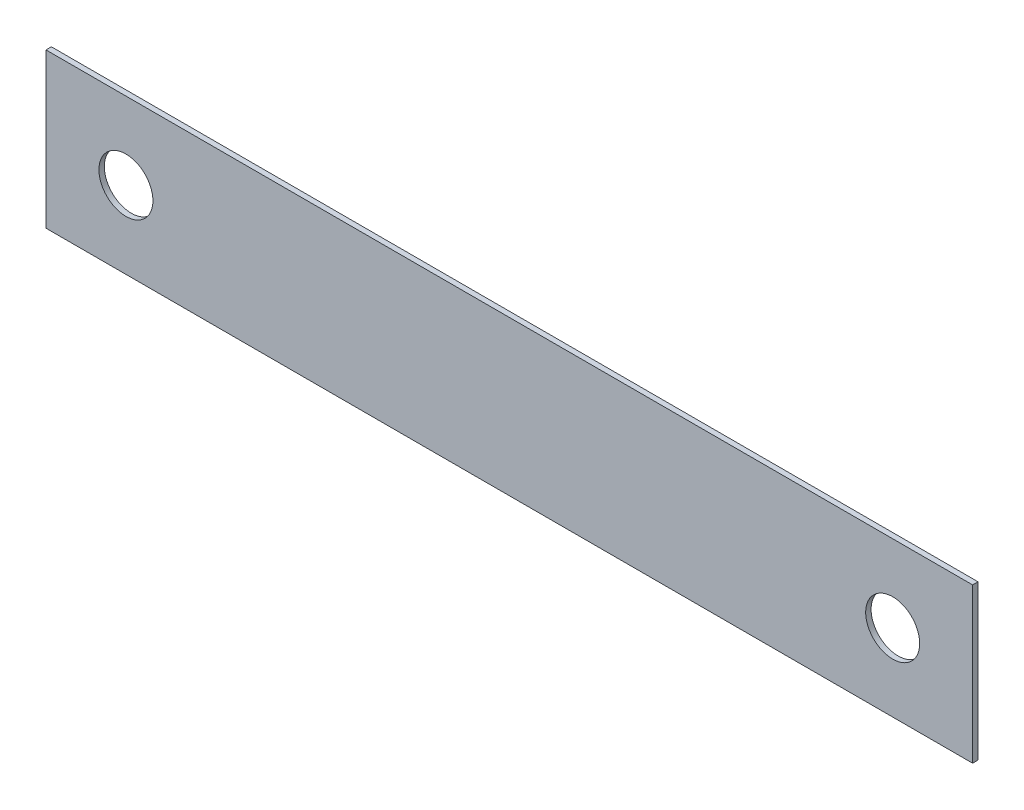
ISO-10303-21;
HEADER;
FILE_DESCRIPTION(('STEP AP214'),'2;1');
FILE_NAME('part.step','',(''),(''),'','','');
FILE_SCHEMA(('AUTOMOTIVE_DESIGN { 1 0 10303 214 1 1 1 1 }'));
ENDSEC;
DATA;
#1=APPLICATION_CONTEXT('core data for automotive mechanical design processes');
#2=APPLICATION_PROTOCOL_DEFINITION('international standard','automotive_design',2000,#1);
#3=PRODUCT_CONTEXT('',#1,'mechanical');
#4=PRODUCT('Part','Part','',(#3));
#5=PRODUCT_RELATED_PRODUCT_CATEGORY('part','',(#4));
#6=PRODUCT_DEFINITION_FORMATION('','',#4);
#7=PRODUCT_DEFINITION_CONTEXT('part definition',#1,'design');
#8=PRODUCT_DEFINITION('design','',#6,#7);
#9=PRODUCT_DEFINITION_SHAPE('','',#8);
#10=(LENGTH_UNIT() NAMED_UNIT(*) SI_UNIT(.MILLI.,.METRE.));
#11=(NAMED_UNIT(*) PLANE_ANGLE_UNIT() SI_UNIT($,.RADIAN.));
#12=(NAMED_UNIT(*) SI_UNIT($,.STERADIAN.) SOLID_ANGLE_UNIT());
#13=UNCERTAINTY_MEASURE_WITH_UNIT(LENGTH_MEASURE(1.E-05),#10,'distance_accuracy_value','');
#14=(GEOMETRIC_REPRESENTATION_CONTEXT(3) GLOBAL_UNCERTAINTY_ASSIGNED_CONTEXT((#13)) GLOBAL_UNIT_ASSIGNED_CONTEXT((#10,
#11,#12)) REPRESENTATION_CONTEXT('',''));
#15=CARTESIAN_POINT('',(0.,0.,0.));
#16=DIRECTION('',(0.,0.,1.));
#17=DIRECTION('',(1.,0.,0.));
#18=AXIS2_PLACEMENT_3D('',#15,#16,#17);
#19=CARTESIAN_POINT('',(0.,0.,0.5));
#20=DIRECTION('',(0.,0.,-1.));
#21=DIRECTION('',(-1.,0.,0.));
#22=AXIS2_PLACEMENT_3D('',#19,#20,#21);
#23=PLANE('',#22);
#24=CARTESIAN_POINT('',(7.40000000000001,7.15000000000001,0.5));
#25=DIRECTION('',(0.,0.,1.));
#26=DIRECTION('',(1.,0.,0.));
#27=AXIS2_PLACEMENT_3D('',#24,#25,#26);
#28=CIRCLE('',#27,2.5);
#29=CARTESIAN_POINT('',(9.90000000000001,7.15000000000001,0.5));
#30=VERTEX_POINT('',#29);
#31=EDGE_CURVE('E101',#30,#30,#28,.T.);
#32=ORIENTED_EDGE('',*,*,#31,.F.);
#33=EDGE_LOOP('',(#32));
#34=FACE_BOUND('',#33,.T.);
#35=DIRECTION('',(0.,-1.,0.));
#36=VECTOR('',#35,1.);
#37=CARTESIAN_POINT('',(0.,0.,0.5));
#38=LINE('',#37,#36);
#39=CARTESIAN_POINT('',(0.,14.3,0.5));
#40=VERTEX_POINT('',#39);
#41=CARTESIAN_POINT('',(0.,0.,0.5));
#42=VERTEX_POINT('',#41);
#43=EDGE_CURVE('E86',#40,#42,#38,.T.);
#44=ORIENTED_EDGE('',*,*,#43,.T.);
#45=DIRECTION('',(1.,0.,0.));
#46=VECTOR('',#45,1.);
#47=CARTESIAN_POINT('',(0.,0.,0.5));
#48=LINE('',#47,#46);
#49=CARTESIAN_POINT('',(85.8,0.,0.5));
#50=VERTEX_POINT('',#49);
#51=EDGE_CURVE('E81',#42,#50,#48,.T.);
#52=ORIENTED_EDGE('',*,*,#51,.T.);
#53=DIRECTION('',(0.,1.,0.));
#54=VECTOR('',#53,1.);
#55=CARTESIAN_POINT('',(85.8,0.,0.5));
#56=LINE('',#55,#54);
#57=CARTESIAN_POINT('',(85.8,14.3,0.5));
#58=VERTEX_POINT('',#57);
#59=EDGE_CURVE('E84',#50,#58,#56,.T.);
#60=ORIENTED_EDGE('',*,*,#59,.T.);
#61=DIRECTION('',(-1.,0.,0.));
#62=VECTOR('',#61,1.);
#63=CARTESIAN_POINT('',(0.,14.3,0.5));
#64=LINE('',#63,#62);
#65=EDGE_CURVE('E51',#58,#40,#64,.T.);
#66=ORIENTED_EDGE('',*,*,#65,.T.);
#67=EDGE_LOOP('',(#44,#52,#60,#66));
#68=FACE_BOUND('',#67,.T.);
#69=CARTESIAN_POINT('',(78.4,7.15000000000002,0.5));
#70=DIRECTION('',(0.,0.,1.));
#71=DIRECTION('',(1.,0.,0.));
#72=AXIS2_PLACEMENT_3D('',#69,#70,#71);
#73=CIRCLE('',#72,2.5);
#74=CARTESIAN_POINT('',(80.9,7.15000000000002,0.5));
#75=VERTEX_POINT('',#74);
#76=EDGE_CURVE('E116',#75,#75,#73,.T.);
#77=ORIENTED_EDGE('',*,*,#76,.F.);
#78=EDGE_LOOP('',(#77));
#79=FACE_BOUND('',#78,.T.);
#80=ADVANCED_FACE('F34',(#34,#68,#79),#23,.F.);
#81=CARTESIAN_POINT('',(0.,0.,0.));
#82=DIRECTION('',(0.,0.,-1.));
#83=DIRECTION('',(-1.,0.,0.));
#84=AXIS2_PLACEMENT_3D('',#81,#82,#83);
#85=PLANE('',#84);
#86=CARTESIAN_POINT('',(7.40000000000001,7.15000000000001,0.));
#87=DIRECTION('',(0.,0.,1.));
#88=DIRECTION('',(1.,0.,0.));
#89=AXIS2_PLACEMENT_3D('',#86,#87,#88);
#90=CIRCLE('',#89,2.5);
#91=CARTESIAN_POINT('',(9.90000000000001,7.15000000000001,0.));
#92=VERTEX_POINT('',#91);
#93=EDGE_CURVE('E113',#92,#92,#90,.T.);
#94=ORIENTED_EDGE('',*,*,#93,.T.);
#95=EDGE_LOOP('',(#94));
#96=FACE_BOUND('',#95,.T.);
#97=DIRECTION('',(0.,-1.,0.));
#98=VECTOR('',#97,1.);
#99=CARTESIAN_POINT('',(0.,0.,0.));
#100=LINE('',#99,#98);
#101=CARTESIAN_POINT('',(0.,14.3,0.));
#102=VERTEX_POINT('',#101);
#103=CARTESIAN_POINT('',(0.,0.,0.));
#104=VERTEX_POINT('',#103);
#105=EDGE_CURVE('E98',#102,#104,#100,.T.);
#106=ORIENTED_EDGE('',*,*,#105,.F.);
#107=DIRECTION('',(-1.,0.,0.));
#108=VECTOR('',#107,1.);
#109=CARTESIAN_POINT('',(0.,14.3,0.));
#110=LINE('',#109,#108);
#111=CARTESIAN_POINT('',(85.8,14.3,0.));
#112=VERTEX_POINT('',#111);
#113=EDGE_CURVE('E74',#112,#102,#110,.T.);
#114=ORIENTED_EDGE('',*,*,#113,.F.);
#115=DIRECTION('',(0.,1.,0.));
#116=VECTOR('',#115,1.);
#117=CARTESIAN_POINT('',(85.8,0.,0.));
#118=LINE('',#117,#116);
#119=CARTESIAN_POINT('',(85.8,0.,0.));
#120=VERTEX_POINT('',#119);
#121=EDGE_CURVE('E68',#120,#112,#118,.T.);
#122=ORIENTED_EDGE('',*,*,#121,.F.);
#123=DIRECTION('',(1.,0.,0.));
#124=VECTOR('',#123,1.);
#125=CARTESIAN_POINT('',(0.,0.,0.));
#126=LINE('',#125,#124);
#127=EDGE_CURVE('E90',#104,#120,#126,.T.);
#128=ORIENTED_EDGE('',*,*,#127,.F.);
#129=EDGE_LOOP('',(#106,#114,#122,#128));
#130=FACE_BOUND('',#129,.T.);
#131=CARTESIAN_POINT('',(78.4,7.15000000000002,0.));
#132=DIRECTION('',(0.,0.,1.));
#133=DIRECTION('',(1.,0.,0.));
#134=AXIS2_PLACEMENT_3D('',#131,#132,#133);
#135=CIRCLE('',#134,2.5);
#136=CARTESIAN_POINT('',(80.9,7.15000000000002,0.));
#137=VERTEX_POINT('',#136);
#138=EDGE_CURVE('E119',#137,#137,#135,.T.);
#139=ORIENTED_EDGE('',*,*,#138,.T.);
#140=EDGE_LOOP('',(#139));
#141=FACE_BOUND('',#140,.T.);
#142=ADVANCED_FACE('F109',(#96,#130,#141),#85,.T.);
#143=CARTESIAN_POINT('',(0.,0.,0.5));
#144=DIRECTION('',(1.,0.,0.));
#145=DIRECTION('',(0.,0.,-1.));
#146=AXIS2_PLACEMENT_3D('',#143,#144,#145);
#147=PLANE('',#146);
#148=ORIENTED_EDGE('',*,*,#105,.T.);
#149=DIRECTION('',(0.,0.,-1.));
#150=VECTOR('',#149,1.);
#151=CARTESIAN_POINT('',(0.,0.,0.5));
#152=LINE('',#151,#150);
#153=EDGE_CURVE('E11',#42,#104,#152,.T.);
#154=ORIENTED_EDGE('',*,*,#153,.F.);
#155=ORIENTED_EDGE('',*,*,#43,.F.);
#156=DIRECTION('',(0.,0.,-1.));
#157=VECTOR('',#156,1.);
#158=CARTESIAN_POINT('',(0.,14.3,0.5));
#159=LINE('',#158,#157);
#160=EDGE_CURVE('E94',#40,#102,#159,.T.);
#161=ORIENTED_EDGE('',*,*,#160,.T.);
#162=EDGE_LOOP('',(#148,#154,#155,#161));
#163=FACE_BOUND('',#162,.T.);
#164=ADVANCED_FACE('F36',(#163),#147,.F.);
#165=CARTESIAN_POINT('',(0.,0.,0.5));
#166=DIRECTION('',(0.,1.,0.));
#167=DIRECTION('',(0.,0.,1.));
#168=AXIS2_PLACEMENT_3D('',#165,#166,#167);
#169=PLANE('',#168);
#170=ORIENTED_EDGE('',*,*,#127,.T.);
#171=DIRECTION('',(0.,0.,-1.));
#172=VECTOR('',#171,1.);
#173=CARTESIAN_POINT('',(85.8,0.,0.5));
#174=LINE('',#173,#172);
#175=EDGE_CURVE('E43',#50,#120,#174,.T.);
#176=ORIENTED_EDGE('',*,*,#175,.F.);
#177=ORIENTED_EDGE('',*,*,#51,.F.);
#178=ORIENTED_EDGE('',*,*,#153,.T.);
#179=EDGE_LOOP('',(#170,#176,#177,#178));
#180=FACE_BOUND('',#179,.T.);
#181=ADVANCED_FACE('F89',(#180),#169,.F.);
#182=CARTESIAN_POINT('',(85.8,0.,0.5));
#183=DIRECTION('',(-1.,0.,0.));
#184=DIRECTION('',(0.,0.,1.));
#185=AXIS2_PLACEMENT_3D('',#182,#183,#184);
#186=PLANE('',#185);
#187=ORIENTED_EDGE('',*,*,#121,.T.);
#188=DIRECTION('',(0.,0.,-1.));
#189=VECTOR('',#188,1.);
#190=CARTESIAN_POINT('',(85.8,14.3,0.5));
#191=LINE('',#190,#189);
#192=EDGE_CURVE('E91',#58,#112,#191,.T.);
#193=ORIENTED_EDGE('',*,*,#192,.F.);
#194=ORIENTED_EDGE('',*,*,#59,.F.);
#195=ORIENTED_EDGE('',*,*,#175,.T.);
#196=EDGE_LOOP('',(#187,#193,#194,#195));
#197=FACE_BOUND('',#196,.T.);
#198=ADVANCED_FACE('F92',(#197),#186,.F.);
#199=CARTESIAN_POINT('',(0.,14.3,0.5));
#200=DIRECTION('',(0.,-1.,0.));
#201=DIRECTION('',(0.,0.,-1.));
#202=AXIS2_PLACEMENT_3D('',#199,#200,#201);
#203=PLANE('',#202);
#204=ORIENTED_EDGE('',*,*,#113,.T.);
#205=ORIENTED_EDGE('',*,*,#160,.F.);
#206=ORIENTED_EDGE('',*,*,#65,.F.);
#207=ORIENTED_EDGE('',*,*,#192,.T.);
#208=EDGE_LOOP('',(#204,#205,#206,#207));
#209=FACE_BOUND('',#208,.T.);
#210=ADVANCED_FACE('F106',(#209),#203,.F.);
#211=CARTESIAN_POINT('',(7.40000000000001,7.15000000000001,0.5));
#212=DIRECTION('',(0.,0.,-1.));
#213=DIRECTION('',(-1.,0.,0.));
#214=AXIS2_PLACEMENT_3D('',#211,#212,#213);
#215=CYLINDRICAL_SURFACE('',#214,2.5);
#216=ORIENTED_EDGE('',*,*,#31,.T.);
#217=EDGE_LOOP('',(#216));
#218=FACE_BOUND('',#217,.T.);
#219=ORIENTED_EDGE('',*,*,#93,.F.);
#220=EDGE_LOOP('',(#219));
#221=FACE_BOUND('',#220,.T.);
#222=ADVANCED_FACE('F137',(#218,#221),#215,.F.);
#223=CARTESIAN_POINT('',(78.4,7.15000000000002,0.5));
#224=DIRECTION('',(0.,0.,-1.));
#225=DIRECTION('',(-1.,0.,0.));
#226=AXIS2_PLACEMENT_3D('',#223,#224,#225);
#227=CYLINDRICAL_SURFACE('',#226,2.5);
#228=ORIENTED_EDGE('',*,*,#76,.T.);
#229=EDGE_LOOP('',(#228));
#230=FACE_BOUND('',#229,.T.);
#231=ORIENTED_EDGE('',*,*,#138,.F.);
#232=EDGE_LOOP('',(#231));
#233=FACE_BOUND('',#232,.T.);
#234=ADVANCED_FACE('F125',(#230,#233),#227,.F.);
#235=CLOSED_SHELL('',(#80,#142,#164,#181,#198,#210,#222,#234));
#236=MANIFOLD_SOLID_BREP('B2',#235);
#237=ADVANCED_BREP_SHAPE_REPRESENTATION('',(#18,#236),#14);
#238=SHAPE_DEFINITION_REPRESENTATION(#9,#237);
ENDSEC;
END-ISO-10303-21;
